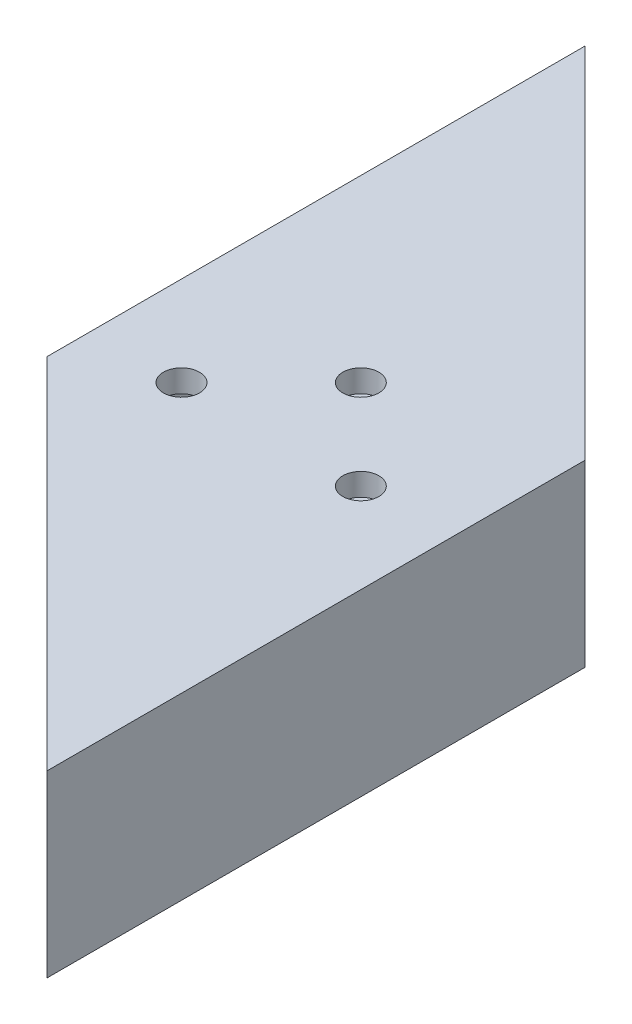
ISO-10303-21;
HEADER;
FILE_DESCRIPTION(('STEP AP214'),'2;1');
FILE_NAME('part.step','',(''),(''),'','','');
FILE_SCHEMA(('AUTOMOTIVE_DESIGN { 1 0 10303 214 1 1 1 1 }'));
ENDSEC;
DATA;
#1=APPLICATION_CONTEXT('core data for automotive mechanical design processes');
#2=APPLICATION_PROTOCOL_DEFINITION('international standard','automotive_design',2000,#1);
#3=PRODUCT_CONTEXT('',#1,'mechanical');
#4=PRODUCT('Part','Part','',(#3));
#5=PRODUCT_RELATED_PRODUCT_CATEGORY('part','',(#4));
#6=PRODUCT_DEFINITION_FORMATION('','',#4);
#7=PRODUCT_DEFINITION_CONTEXT('part definition',#1,'design');
#8=PRODUCT_DEFINITION('design','',#6,#7);
#9=PRODUCT_DEFINITION_SHAPE('','',#8);
#10=(LENGTH_UNIT() NAMED_UNIT(*) SI_UNIT(.MILLI.,.METRE.));
#11=(NAMED_UNIT(*) PLANE_ANGLE_UNIT() SI_UNIT($,.RADIAN.));
#12=(NAMED_UNIT(*) SI_UNIT($,.STERADIAN.) SOLID_ANGLE_UNIT());
#13=UNCERTAINTY_MEASURE_WITH_UNIT(LENGTH_MEASURE(1.E-05),#10,'distance_accuracy_value','');
#14=(GEOMETRIC_REPRESENTATION_CONTEXT(3) GLOBAL_UNCERTAINTY_ASSIGNED_CONTEXT((#13)) GLOBAL_UNIT_ASSIGNED_CONTEXT((#10,
#11,#12)) REPRESENTATION_CONTEXT('',''));
#15=CARTESIAN_POINT('',(0.,0.,0.));
#16=DIRECTION('',(0.,0.,1.));
#17=DIRECTION('',(1.,0.,0.));
#18=AXIS2_PLACEMENT_3D('',#15,#16,#17);
#19=CARTESIAN_POINT('',(0.,0.,127.));
#20=DIRECTION('',(1.,0.,0.));
#21=DIRECTION('',(0.,0.,-1.));
#22=AXIS2_PLACEMENT_3D('',#19,#20,#21);
#23=PLANE('',#22);
#24=DIRECTION('',(0.,0.,-1.));
#25=VECTOR('',#24,1.);
#26=CARTESIAN_POINT('',(0.,0.,127.));
#27=LINE('',#26,#25);
#28=CARTESIAN_POINT('',(0.,0.,76.1999999999995));
#29=VERTEX_POINT('',#28);
#30=CARTESIAN_POINT('',(0.,0.,0.));
#31=VERTEX_POINT('',#30);
#32=EDGE_CURVE('E117',#29,#31,#27,.T.);
#33=ORIENTED_EDGE('',*,*,#32,.F.);
#34=DIRECTION('',(0.,1.,0.));
#35=VECTOR('',#34,1.);
#36=CARTESIAN_POINT('',(0.,-101.6,76.1999999999995));
#37=LINE('',#36,#35);
#38=CARTESIAN_POINT('',(0.,25.4,76.1999999999995));
#39=VERTEX_POINT('',#38);
#40=EDGE_CURVE('E102',#29,#39,#37,.T.);
#41=ORIENTED_EDGE('',*,*,#40,.T.);
#42=DIRECTION('',(0.,0.,-1.));
#43=VECTOR('',#42,1.);
#44=CARTESIAN_POINT('',(0.,25.4,127.));
#45=LINE('',#44,#43);
#46=CARTESIAN_POINT('',(0.,25.4,0.));
#47=VERTEX_POINT('',#46);
#48=EDGE_CURVE('E115',#39,#47,#45,.T.);
#49=ORIENTED_EDGE('',*,*,#48,.T.);
#50=DIRECTION('',(0.,-1.,0.));
#51=VECTOR('',#50,1.);
#52=CARTESIAN_POINT('',(0.,0.,0.));
#53=LINE('',#52,#51);
#54=EDGE_CURVE('E127',#47,#31,#53,.T.);
#55=ORIENTED_EDGE('',*,*,#54,.T.);
#56=EDGE_LOOP('',(#33,#41,#49,#55));
#57=FACE_BOUND('',#56,.T.);
#58=ADVANCED_FACE('F33',(#57),#23,.F.);
#59=CARTESIAN_POINT('',(0.,0.,127.));
#60=DIRECTION('',(0.,1.,0.));
#61=DIRECTION('',(0.,0.,1.));
#62=AXIS2_PLACEMENT_3D('',#59,#60,#61);
#63=PLANE('',#62);
#64=CARTESIAN_POINT('',(25.4,0.,57.1500000000005));
#65=DIRECTION('',(0.,1.,0.));
#66=DIRECTION('',(0.,0.,1.));
#67=AXIS2_PLACEMENT_3D('',#64,#65,#66);
#68=CIRCLE('',#67,2.55269999999999);
#69=CARTESIAN_POINT('',(25.4,0.,59.7027000000005));
#70=VERTEX_POINT('',#69);
#71=EDGE_CURVE('E356',#70,#70,#68,.T.);
#72=ORIENTED_EDGE('',*,*,#71,.T.);
#73=EDGE_LOOP('',(#72));
#74=FACE_BOUND('',#73,.T.);
#75=CARTESIAN_POINT('',(38.1,0.,69.8500000000005));
#76=DIRECTION('',(0.,1.,0.));
#77=DIRECTION('',(0.,0.,1.));
#78=AXIS2_PLACEMENT_3D('',#75,#76,#77);
#79=CIRCLE('',#78,2.5527);
#80=CARTESIAN_POINT('',(38.1,0.,72.4027000000005));
#81=VERTEX_POINT('',#80);
#82=EDGE_CURVE('E142',#81,#81,#79,.T.);
#83=ORIENTED_EDGE('',*,*,#82,.T.);
#84=EDGE_LOOP('',(#83));
#85=FACE_BOUND('',#84,.T.);
#86=CARTESIAN_POINT('',(12.7,0.,69.8500000000005));
#87=DIRECTION('',(0.,1.,0.));
#88=DIRECTION('',(0.,0.,1.));
#89=AXIS2_PLACEMENT_3D('',#86,#87,#88);
#90=CIRCLE('',#89,2.5527);
#91=CARTESIAN_POINT('',(12.7,0.,72.4027000000005));
#92=VERTEX_POINT('',#91);
#93=EDGE_CURVE('E138',#92,#92,#90,.T.);
#94=ORIENTED_EDGE('',*,*,#93,.T.);
#95=EDGE_LOOP('',(#94));
#96=FACE_BOUND('',#95,.T.);
#97=DIRECTION('',(0.,0.,-1.));
#98=VECTOR('',#97,1.);
#99=CARTESIAN_POINT('',(50.8,0.,127.));
#100=LINE('',#99,#98);
#101=CARTESIAN_POINT('',(50.8,0.,127.));
#102=VERTEX_POINT('',#101);
#103=CARTESIAN_POINT('',(50.8,0.,50.8000000000005));
#104=VERTEX_POINT('',#103);
#105=EDGE_CURVE('E125',#102,#104,#100,.T.);
#106=ORIENTED_EDGE('',*,*,#105,.F.);
#107=DIRECTION('',(-0.707106781186544,0.,-0.707106781186551));
#108=VECTOR('',#107,1.);
#109=CARTESIAN_POINT('',(25.4000000000003,0.,101.6));
#110=LINE('',#109,#108);
#111=EDGE_CURVE('E169',#102,#29,#110,.T.);
#112=ORIENTED_EDGE('',*,*,#111,.T.);
#113=ORIENTED_EDGE('',*,*,#32,.T.);
#114=DIRECTION('',(0.707106781186544,0.,0.707106781186551));
#115=VECTOR('',#114,1.);
#116=CARTESIAN_POINT('',(63.5,0.,63.5000000000007));
#117=LINE('',#116,#115);
#118=EDGE_CURVE('E183',#31,#104,#117,.T.);
#119=ORIENTED_EDGE('',*,*,#118,.T.);
#120=EDGE_LOOP('',(#106,#112,#113,#119));
#121=FACE_BOUND('',#120,.T.);
#122=ADVANCED_FACE('F200',(#74,#85,#96,#121),#63,.F.);
#123=CARTESIAN_POINT('',(50.8,0.,127.));
#124=DIRECTION('',(-1.,0.,0.));
#125=DIRECTION('',(0.,0.,1.));
#126=AXIS2_PLACEMENT_3D('',#123,#124,#125);
#127=PLANE('',#126);
#128=ORIENTED_EDGE('',*,*,#105,.T.);
#129=DIRECTION('',(0.,1.,0.));
#130=VECTOR('',#129,1.);
#131=CARTESIAN_POINT('',(50.8,-101.6,50.8000000000005));
#132=LINE('',#131,#130);
#133=CARTESIAN_POINT('',(50.8,25.4,50.8000000000005));
#134=VERTEX_POINT('',#133);
#135=EDGE_CURVE('E172',#104,#134,#132,.T.);
#136=ORIENTED_EDGE('',*,*,#135,.T.);
#137=DIRECTION('',(0.,0.,-1.));
#138=VECTOR('',#137,1.);
#139=CARTESIAN_POINT('',(50.8,25.4,127.));
#140=LINE('',#139,#138);
#141=CARTESIAN_POINT('',(50.8,25.4,127.));
#142=VERTEX_POINT('',#141);
#143=EDGE_CURVE('E123',#142,#134,#140,.T.);
#144=ORIENTED_EDGE('',*,*,#143,.F.);
#145=DIRECTION('',(0.,1.,0.));
#146=VECTOR('',#145,1.);
#147=CARTESIAN_POINT('',(50.8,0.,127.));
#148=LINE('',#147,#146);
#149=EDGE_CURVE('E105',#102,#142,#148,.T.);
#150=ORIENTED_EDGE('',*,*,#149,.F.);
#151=EDGE_LOOP('',(#128,#136,#144,#150));
#152=FACE_BOUND('',#151,.T.);
#153=ADVANCED_FACE('F202',(#152),#127,.F.);
#154=CARTESIAN_POINT('',(0.,25.4,127.));
#155=DIRECTION('',(0.,-1.,0.));
#156=DIRECTION('',(0.,0.,-1.));
#157=AXIS2_PLACEMENT_3D('',#154,#155,#156);
#158=PLANE('',#157);
#159=CARTESIAN_POINT('',(25.4,25.4,57.1500000000005));
#160=DIRECTION('',(0.,1.,0.));
#161=DIRECTION('',(0.,0.,1.));
#162=AXIS2_PLACEMENT_3D('',#159,#160,#161);
#163=CIRCLE('',#162,2.55269999999999);
#164=CARTESIAN_POINT('',(25.4,25.4,59.7027000000005));
#165=VERTEX_POINT('',#164);
#166=EDGE_CURVE('E357',#165,#165,#163,.T.);
#167=ORIENTED_EDGE('',*,*,#166,.F.);
#168=EDGE_LOOP('',(#167));
#169=FACE_BOUND('',#168,.T.);
#170=CARTESIAN_POINT('',(38.1,25.4,69.8500000000005));
#171=DIRECTION('',(0.,1.,0.));
#172=DIRECTION('',(0.,0.,1.));
#173=AXIS2_PLACEMENT_3D('',#170,#171,#172);
#174=CIRCLE('',#173,2.5527);
#175=CARTESIAN_POINT('',(38.1,25.4,72.4027000000005));
#176=VERTEX_POINT('',#175);
#177=EDGE_CURVE('E149',#176,#176,#174,.T.);
#178=ORIENTED_EDGE('',*,*,#177,.F.);
#179=EDGE_LOOP('',(#178));
#180=FACE_BOUND('',#179,.T.);
#181=CARTESIAN_POINT('',(12.7,25.4,69.8500000000005));
#182=DIRECTION('',(0.,1.,0.));
#183=DIRECTION('',(0.,0.,1.));
#184=AXIS2_PLACEMENT_3D('',#181,#182,#183);
#185=CIRCLE('',#184,2.5527);
#186=CARTESIAN_POINT('',(12.7,25.4,72.4027000000005));
#187=VERTEX_POINT('',#186);
#188=EDGE_CURVE('E146',#187,#187,#185,.T.);
#189=ORIENTED_EDGE('',*,*,#188,.F.);
#190=EDGE_LOOP('',(#189));
#191=FACE_BOUND('',#190,.T.);
#192=ORIENTED_EDGE('',*,*,#48,.F.);
#193=DIRECTION('',(-0.707106781186544,0.,-0.707106781186551));
#194=VECTOR('',#193,1.);
#195=CARTESIAN_POINT('',(50.8,25.4,127.));
#196=LINE('',#195,#194);
#197=EDGE_CURVE('E99',#142,#39,#196,.T.);
#198=ORIENTED_EDGE('',*,*,#197,.F.);
#199=ORIENTED_EDGE('',*,*,#143,.T.);
#200=DIRECTION('',(0.707106781186544,0.,0.707106781186551));
#201=VECTOR('',#200,1.);
#202=CARTESIAN_POINT('',(0.,25.4,0.));
#203=LINE('',#202,#201);
#204=EDGE_CURVE('E122',#47,#134,#203,.T.);
#205=ORIENTED_EDGE('',*,*,#204,.F.);
#206=EDGE_LOOP('',(#192,#198,#199,#205));
#207=FACE_BOUND('',#206,.T.);
#208=ADVANCED_FACE('F121',(#169,#180,#191,#207),#158,.F.);
#209=CARTESIAN_POINT('',(3.175,3.175,127.));
#210=DIRECTION('',(1.,0.,0.));
#211=DIRECTION('',(0.,0.,-1.));
#212=AXIS2_PLACEMENT_3D('',#209,#210,#211);
#213=PLANE('',#212);
#214=DIRECTION('',(0.,1.,0.));
#215=VECTOR('',#214,1.);
#216=CARTESIAN_POINT('',(3.175,3.175,79.3749999999995));
#217=LINE('',#216,#215);
#218=CARTESIAN_POINT('',(3.175,3.175,79.3749999999995));
#219=VERTEX_POINT('',#218);
#220=CARTESIAN_POINT('',(3.175,22.225,79.3749999999995));
#221=VERTEX_POINT('',#220);
#222=EDGE_CURVE('E48',#219,#221,#217,.T.);
#223=ORIENTED_EDGE('',*,*,#222,.F.);
#224=DIRECTION('',(0.,0.,-1.));
#225=VECTOR('',#224,1.);
#226=CARTESIAN_POINT('',(3.175,3.175,127.));
#227=LINE('',#226,#225);
#228=CARTESIAN_POINT('',(3.175,3.175,3.17500000000001));
#229=VERTEX_POINT('',#228);
#230=EDGE_CURVE('E191',#219,#229,#227,.T.);
#231=ORIENTED_EDGE('',*,*,#230,.T.);
#232=DIRECTION('',(0.,-1.,0.));
#233=VECTOR('',#232,1.);
#234=CARTESIAN_POINT('',(3.175,3.175,3.17500000000003));
#235=LINE('',#234,#233);
#236=CARTESIAN_POINT('',(3.175,22.225,3.17500000000001));
#237=VERTEX_POINT('',#236);
#238=EDGE_CURVE('E180',#237,#229,#235,.T.);
#239=ORIENTED_EDGE('',*,*,#238,.F.);
#240=DIRECTION('',(0.,0.,-1.));
#241=VECTOR('',#240,1.);
#242=CARTESIAN_POINT('',(3.175,22.225,127.));
#243=LINE('',#242,#241);
#244=EDGE_CURVE('E186',#221,#237,#243,.T.);
#245=ORIENTED_EDGE('',*,*,#244,.F.);
#246=EDGE_LOOP('',(#223,#231,#239,#245));
#247=FACE_BOUND('',#246,.T.);
#248=ADVANCED_FACE('F210',(#247),#213,.T.);
#249=CARTESIAN_POINT('',(3.175,3.175,127.));
#250=DIRECTION('',(0.,1.,0.));
#251=DIRECTION('',(0.,0.,1.));
#252=AXIS2_PLACEMENT_3D('',#249,#250,#251);
#253=PLANE('',#252);
#254=CARTESIAN_POINT('',(25.4,3.175,57.1500000000005));
#255=DIRECTION('',(0.,1.,0.));
#256=DIRECTION('',(0.,0.,1.));
#257=AXIS2_PLACEMENT_3D('',#254,#255,#256);
#258=CIRCLE('',#257,2.55269999999999);
#259=CARTESIAN_POINT('',(25.4,3.175,59.7027000000005));
#260=VERTEX_POINT('',#259);
#261=EDGE_CURVE('E154',#260,#260,#258,.T.);
#262=ORIENTED_EDGE('',*,*,#261,.F.);
#263=EDGE_LOOP('',(#262));
#264=FACE_BOUND('',#263,.T.);
#265=CARTESIAN_POINT('',(38.1,3.175,69.8500000000005));
#266=DIRECTION('',(0.,1.,0.));
#267=DIRECTION('',(0.,0.,1.));
#268=AXIS2_PLACEMENT_3D('',#265,#266,#267);
#269=CIRCLE('',#268,2.5527);
#270=CARTESIAN_POINT('',(38.1,3.175,72.4027000000005));
#271=VERTEX_POINT('',#270);
#272=EDGE_CURVE('E141',#271,#271,#269,.T.);
#273=ORIENTED_EDGE('',*,*,#272,.F.);
#274=EDGE_LOOP('',(#273));
#275=FACE_BOUND('',#274,.T.);
#276=CARTESIAN_POINT('',(12.7,3.175,69.8500000000005));
#277=DIRECTION('',(0.,1.,0.));
#278=DIRECTION('',(0.,0.,1.));
#279=AXIS2_PLACEMENT_3D('',#276,#277,#278);
#280=CIRCLE('',#279,2.5527);
#281=CARTESIAN_POINT('',(12.7,3.175,72.4027000000005));
#282=VERTEX_POINT('',#281);
#283=EDGE_CURVE('E110',#282,#282,#280,.T.);
#284=ORIENTED_EDGE('',*,*,#283,.F.);
#285=EDGE_LOOP('',(#284));
#286=FACE_BOUND('',#285,.T.);
#287=DIRECTION('',(-0.707106781186544,0.,-0.707106781186551));
#288=VECTOR('',#287,1.);
#289=CARTESIAN_POINT('',(26.9875000000002,3.175,103.1875));
#290=LINE('',#289,#288);
#291=CARTESIAN_POINT('',(47.625,3.175,123.825));
#292=VERTEX_POINT('',#291);
#293=EDGE_CURVE('E166',#292,#219,#290,.T.);
#294=ORIENTED_EDGE('',*,*,#293,.F.);
#295=DIRECTION('',(0.,0.,-1.));
#296=VECTOR('',#295,1.);
#297=CARTESIAN_POINT('',(47.625,3.175,127.));
#298=LINE('',#297,#296);
#299=CARTESIAN_POINT('',(47.625,3.175,47.6250000000005));
#300=VERTEX_POINT('',#299);
#301=EDGE_CURVE('E189',#292,#300,#298,.T.);
#302=ORIENTED_EDGE('',*,*,#301,.T.);
#303=DIRECTION('',(0.707106781186544,0.,0.707106781186551));
#304=VECTOR('',#303,1.);
#305=CARTESIAN_POINT('',(65.0875,3.175,65.0875000000006));
#306=LINE('',#305,#304);
#307=EDGE_CURVE('E177',#229,#300,#306,.T.);
#308=ORIENTED_EDGE('',*,*,#307,.F.);
#309=ORIENTED_EDGE('',*,*,#230,.F.);
#310=EDGE_LOOP('',(#294,#302,#308,#309));
#311=FACE_BOUND('',#310,.T.);
#312=ADVANCED_FACE('F236',(#264,#275,#286,#311),#253,.T.);
#313=CARTESIAN_POINT('',(47.625,3.175,127.));
#314=DIRECTION('',(-1.,0.,0.));
#315=DIRECTION('',(0.,0.,1.));
#316=AXIS2_PLACEMENT_3D('',#313,#314,#315);
#317=PLANE('',#316);
#318=DIRECTION('',(0.,-1.,0.));
#319=VECTOR('',#318,1.);
#320=CARTESIAN_POINT('',(47.625,3.175,123.825));
#321=LINE('',#320,#319);
#322=CARTESIAN_POINT('',(47.625,22.225,123.825));
#323=VERTEX_POINT('',#322);
#324=EDGE_CURVE('E118',#323,#292,#321,.T.);
#325=ORIENTED_EDGE('',*,*,#324,.F.);
#326=DIRECTION('',(0.,0.,-1.));
#327=VECTOR('',#326,1.);
#328=CARTESIAN_POINT('',(47.625,22.225,127.));
#329=LINE('',#328,#327);
#330=CARTESIAN_POINT('',(47.625,22.225,47.6250000000005));
#331=VERTEX_POINT('',#330);
#332=EDGE_CURVE('E56',#323,#331,#329,.T.);
#333=ORIENTED_EDGE('',*,*,#332,.T.);
#334=DIRECTION('',(0.,1.,0.));
#335=VECTOR('',#334,1.);
#336=CARTESIAN_POINT('',(47.625,3.175,47.6250000000005));
#337=LINE('',#336,#335);
#338=EDGE_CURVE('E175',#300,#331,#337,.T.);
#339=ORIENTED_EDGE('',*,*,#338,.F.);
#340=ORIENTED_EDGE('',*,*,#301,.F.);
#341=EDGE_LOOP('',(#325,#333,#339,#340));
#342=FACE_BOUND('',#341,.T.);
#343=ADVANCED_FACE('F240',(#342),#317,.T.);
#344=CARTESIAN_POINT('',(3.175,22.225,127.));
#345=DIRECTION('',(0.,-1.,0.));
#346=DIRECTION('',(0.,0.,-1.));
#347=AXIS2_PLACEMENT_3D('',#344,#345,#346);
#348=PLANE('',#347);
#349=CARTESIAN_POINT('',(25.4,22.225,57.1500000000005));
#350=DIRECTION('',(0.,-1.,0.));
#351=DIRECTION('',(0.,0.,-1.));
#352=AXIS2_PLACEMENT_3D('',#349,#350,#351);
#353=CIRCLE('',#352,2.55269999999999);
#354=CARTESIAN_POINT('',(25.4,22.225,54.5973000000005));
#355=VERTEX_POINT('',#354);
#356=EDGE_CURVE('E36',#355,#355,#353,.T.);
#357=ORIENTED_EDGE('',*,*,#356,.F.);
#358=EDGE_LOOP('',(#357));
#359=FACE_BOUND('',#358,.T.);
#360=CARTESIAN_POINT('',(38.1,22.225,69.8500000000005));
#361=DIRECTION('',(0.,-1.,0.));
#362=DIRECTION('',(0.,0.,-1.));
#363=AXIS2_PLACEMENT_3D('',#360,#361,#362);
#364=CIRCLE('',#363,2.5527);
#365=CARTESIAN_POINT('',(38.1,22.225,67.2973000000005));
#366=VERTEX_POINT('',#365);
#367=EDGE_CURVE('E139',#366,#366,#364,.T.);
#368=ORIENTED_EDGE('',*,*,#367,.F.);
#369=EDGE_LOOP('',(#368));
#370=FACE_BOUND('',#369,.T.);
#371=CARTESIAN_POINT('',(12.7,22.225,69.8500000000005));
#372=DIRECTION('',(0.,-1.,0.));
#373=DIRECTION('',(0.,0.,-1.));
#374=AXIS2_PLACEMENT_3D('',#371,#372,#373);
#375=CIRCLE('',#374,2.5527);
#376=CARTESIAN_POINT('',(12.7,22.225,67.2973000000005));
#377=VERTEX_POINT('',#376);
#378=EDGE_CURVE('E136',#377,#377,#375,.T.);
#379=ORIENTED_EDGE('',*,*,#378,.F.);
#380=EDGE_LOOP('',(#379));
#381=FACE_BOUND('',#380,.T.);
#382=DIRECTION('',(0.707106781186544,0.,0.707106781186551));
#383=VECTOR('',#382,1.);
#384=CARTESIAN_POINT('',(26.9875000000002,22.225,103.1875));
#385=LINE('',#384,#383);
#386=EDGE_CURVE('E11',#221,#323,#385,.T.);
#387=ORIENTED_EDGE('',*,*,#386,.F.);
#388=ORIENTED_EDGE('',*,*,#244,.T.);
#389=DIRECTION('',(-0.707106781186544,0.,-0.707106781186551));
#390=VECTOR('',#389,1.);
#391=CARTESIAN_POINT('',(65.0875,22.225,65.0875000000006));
#392=LINE('',#391,#390);
#393=EDGE_CURVE('E41',#331,#237,#392,.T.);
#394=ORIENTED_EDGE('',*,*,#393,.F.);
#395=ORIENTED_EDGE('',*,*,#332,.F.);
#396=EDGE_LOOP('',(#387,#388,#394,#395));
#397=FACE_BOUND('',#396,.T.);
#398=ADVANCED_FACE('F246',(#359,#370,#381,#397),#348,.T.);
#399=CARTESIAN_POINT('',(0.,-101.6,0.));
#400=DIRECTION('',(-0.707106781186551,0.,0.707106781186544));
#401=DIRECTION('',(0.707106781186544,0.,0.707106781186551));
#402=AXIS2_PLACEMENT_3D('',#399,#400,#401);
#403=PLANE('',#402);
#404=ORIENTED_EDGE('',*,*,#238,.T.);
#405=ORIENTED_EDGE('',*,*,#307,.T.);
#406=ORIENTED_EDGE('',*,*,#338,.T.);
#407=ORIENTED_EDGE('',*,*,#393,.T.);
#408=EDGE_LOOP('',(#404,#405,#406,#407));
#409=FACE_BOUND('',#408,.T.);
#410=ORIENTED_EDGE('',*,*,#54,.F.);
#411=ORIENTED_EDGE('',*,*,#204,.T.);
#412=ORIENTED_EDGE('',*,*,#135,.F.);
#413=ORIENTED_EDGE('',*,*,#118,.F.);
#414=EDGE_LOOP('',(#410,#411,#412,#413));
#415=FACE_BOUND('',#414,.T.);
#416=ADVANCED_FACE('F197',(#409,#415),#403,.F.);
#417=CARTESIAN_POINT('',(50.8,-101.6,127.));
#418=DIRECTION('',(0.707106781186551,0.,-0.707106781186544));
#419=DIRECTION('',(-0.707106781186544,0.,-0.707106781186551));
#420=AXIS2_PLACEMENT_3D('',#417,#418,#419);
#421=PLANE('',#420);
#422=ORIENTED_EDGE('',*,*,#222,.T.);
#423=ORIENTED_EDGE('',*,*,#386,.T.);
#424=ORIENTED_EDGE('',*,*,#324,.T.);
#425=ORIENTED_EDGE('',*,*,#293,.T.);
#426=EDGE_LOOP('',(#422,#423,#424,#425));
#427=FACE_BOUND('',#426,.T.);
#428=ORIENTED_EDGE('',*,*,#149,.T.);
#429=ORIENTED_EDGE('',*,*,#197,.T.);
#430=ORIENTED_EDGE('',*,*,#40,.F.);
#431=ORIENTED_EDGE('',*,*,#111,.F.);
#432=EDGE_LOOP('',(#428,#429,#430,#431));
#433=FACE_BOUND('',#432,.T.);
#434=ADVANCED_FACE('F101',(#427,#433),#421,.F.);
#435=CARTESIAN_POINT('',(12.7,0.,69.8500000000005));
#436=DIRECTION('',(0.,1.,0.));
#437=DIRECTION('',(0.,0.,1.));
#438=AXIS2_PLACEMENT_3D('',#435,#436,#437);
#439=CYLINDRICAL_SURFACE('',#438,2.5527);
#440=ORIENTED_EDGE('',*,*,#378,.T.);
#441=EDGE_LOOP('',(#440));
#442=FACE_BOUND('',#441,.T.);
#443=ORIENTED_EDGE('',*,*,#188,.T.);
#444=EDGE_LOOP('',(#443));
#445=FACE_BOUND('',#444,.T.);
#446=ADVANCED_FACE('F255',(#442,#445),#439,.F.);
#447=ORIENTED_EDGE('',*,*,#283,.T.);
#448=EDGE_LOOP('',(#447));
#449=FACE_BOUND('',#448,.T.);
#450=ORIENTED_EDGE('',*,*,#93,.F.);
#451=EDGE_LOOP('',(#450));
#452=FACE_BOUND('',#451,.T.);
#453=ADVANCED_FACE('F260',(#449,#452),#439,.F.);
#454=CARTESIAN_POINT('',(38.1,0.,69.8500000000005));
#455=DIRECTION('',(0.,1.,0.));
#456=DIRECTION('',(0.,0.,1.));
#457=AXIS2_PLACEMENT_3D('',#454,#455,#456);
#458=CYLINDRICAL_SURFACE('',#457,2.5527);
#459=ORIENTED_EDGE('',*,*,#367,.T.);
#460=EDGE_LOOP('',(#459));
#461=FACE_BOUND('',#460,.T.);
#462=ORIENTED_EDGE('',*,*,#177,.T.);
#463=EDGE_LOOP('',(#462));
#464=FACE_BOUND('',#463,.T.);
#465=ADVANCED_FACE('F270',(#461,#464),#458,.F.);
#466=ORIENTED_EDGE('',*,*,#272,.T.);
#467=EDGE_LOOP('',(#466));
#468=FACE_BOUND('',#467,.T.);
#469=ORIENTED_EDGE('',*,*,#82,.F.);
#470=EDGE_LOOP('',(#469));
#471=FACE_BOUND('',#470,.T.);
#472=ADVANCED_FACE('F279',(#468,#471),#458,.F.);
#473=CARTESIAN_POINT('',(25.4,0.,57.1500000000005));
#474=DIRECTION('',(0.,1.,0.));
#475=DIRECTION('',(0.,0.,1.));
#476=AXIS2_PLACEMENT_3D('',#473,#474,#475);
#477=CYLINDRICAL_SURFACE('',#476,2.55269999999999);
#478=ORIENTED_EDGE('',*,*,#356,.T.);
#479=EDGE_LOOP('',(#478));
#480=FACE_BOUND('',#479,.T.);
#481=ORIENTED_EDGE('',*,*,#166,.T.);
#482=EDGE_LOOP('',(#481));
#483=FACE_BOUND('',#482,.T.);
#484=ADVANCED_FACE('F288',(#480,#483),#477,.F.);
#485=ORIENTED_EDGE('',*,*,#261,.T.);
#486=EDGE_LOOP('',(#485));
#487=FACE_BOUND('',#486,.T.);
#488=ORIENTED_EDGE('',*,*,#71,.F.);
#489=EDGE_LOOP('',(#488));
#490=FACE_BOUND('',#489,.T.);
#491=ADVANCED_FACE('F297',(#487,#490),#477,.F.);
#492=CLOSED_SHELL('',(#58,#122,#153,#208,#248,#312,#343,#398,#416,#434,#446,#453,#465,#472,#484,#491));
#493=MANIFOLD_SOLID_BREP('B2',#492);
#494=ADVANCED_BREP_SHAPE_REPRESENTATION('',(#18,#493),#14);
#495=SHAPE_DEFINITION_REPRESENTATION(#9,#494);
ENDSEC;
END-ISO-10303-21;
